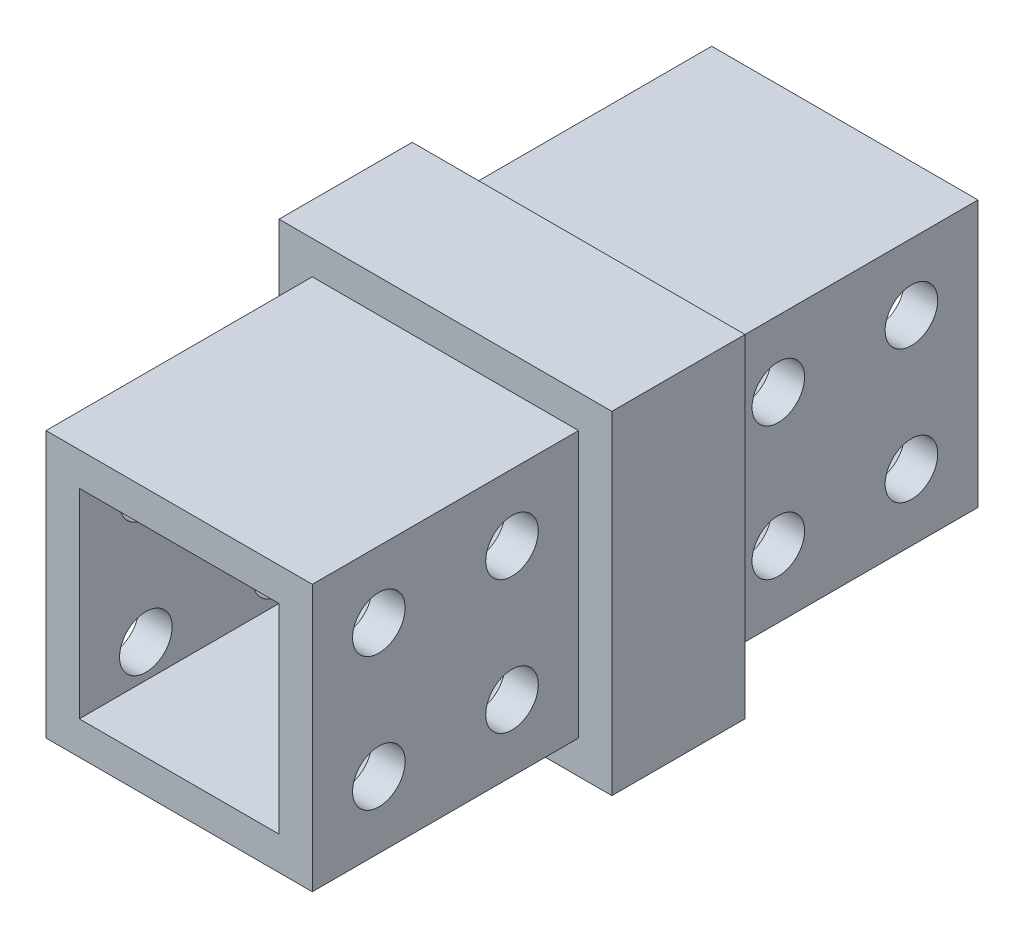
ISO-10303-21;
HEADER;
FILE_DESCRIPTION(('STEP AP214'),'2;1');
FILE_NAME('part.step','',(''),(''),'','','');
FILE_SCHEMA(('AUTOMOTIVE_DESIGN { 1 0 10303 214 1 1 1 1 }'));
ENDSEC;
DATA;
#1=APPLICATION_CONTEXT('core data for automotive mechanical design processes');
#2=APPLICATION_PROTOCOL_DEFINITION('international standard','automotive_design',2000,#1);
#3=PRODUCT_CONTEXT('',#1,'mechanical');
#4=PRODUCT('Part','Part','',(#3));
#5=PRODUCT_RELATED_PRODUCT_CATEGORY('part','',(#4));
#6=PRODUCT_DEFINITION_FORMATION('','',#4);
#7=PRODUCT_DEFINITION_CONTEXT('part definition',#1,'design');
#8=PRODUCT_DEFINITION('design','',#6,#7);
#9=PRODUCT_DEFINITION_SHAPE('','',#8);
#10=(LENGTH_UNIT() NAMED_UNIT(*) SI_UNIT(.MILLI.,.METRE.));
#11=(NAMED_UNIT(*) PLANE_ANGLE_UNIT() SI_UNIT($,.RADIAN.));
#12=(NAMED_UNIT(*) SI_UNIT($,.STERADIAN.) SOLID_ANGLE_UNIT());
#13=UNCERTAINTY_MEASURE_WITH_UNIT(LENGTH_MEASURE(1.E-05),#10,'distance_accuracy_value','');
#14=(GEOMETRIC_REPRESENTATION_CONTEXT(3) GLOBAL_UNCERTAINTY_ASSIGNED_CONTEXT((#13)) GLOBAL_UNIT_ASSIGNED_CONTEXT((#10,
#11,#12)) REPRESENTATION_CONTEXT('',''));
#15=CARTESIAN_POINT('',(0.,0.,0.));
#16=DIRECTION('',(0.,0.,1.));
#17=DIRECTION('',(1.,0.,0.));
#18=AXIS2_PLACEMENT_3D('',#15,#16,#17);
#19=CARTESIAN_POINT('',(-25.4,-6.35000000000001,57.15));
#20=DIRECTION('',(1.,0.,0.));
#21=DIRECTION('',(0.,1.,0.));
#22=AXIS2_PLACEMENT_3D('',#19,#20,#21);
#23=CYLINDRICAL_SURFACE('',#22,2.50825000000001);
#24=CARTESIAN_POINT('',(-22.225,-6.35000000000001,57.15));
#25=DIRECTION('',(-1.,0.,0.));
#26=DIRECTION('',(0.,-1.,0.));
#27=AXIS2_PLACEMENT_3D('',#24,#25,#26);
#28=CIRCLE('',#27,2.50825000000001);
#29=CARTESIAN_POINT('',(-22.225,-8.85825000000001,57.15));
#30=VERTEX_POINT('',#29);
#31=EDGE_CURVE('E204',#30,#30,#28,.F.);
#32=ORIENTED_EDGE('',*,*,#31,.T.);
#33=EDGE_LOOP('',(#32));
#34=FACE_BOUND('',#33,.T.);
#35=CARTESIAN_POINT('',(-25.4,-6.35000000000001,57.15));
#36=DIRECTION('',(1.,0.,0.));
#37=DIRECTION('',(0.,1.,0.));
#38=AXIS2_PLACEMENT_3D('',#35,#36,#37);
#39=CIRCLE('',#38,2.50825000000001);
#40=CARTESIAN_POINT('',(-25.4,-3.84175,57.15));
#41=VERTEX_POINT('',#40);
#42=EDGE_CURVE('E226',#41,#41,#39,.T.);
#43=ORIENTED_EDGE('',*,*,#42,.F.);
#44=EDGE_LOOP('',(#43));
#45=FACE_BOUND('',#44,.T.);
#46=ADVANCED_FACE('F32',(#34,#45),#23,.F.);
#47=CARTESIAN_POINT('',(-25.4,-19.05,44.45));
#48=DIRECTION('',(1.,0.,0.));
#49=DIRECTION('',(0.,1.,0.));
#50=AXIS2_PLACEMENT_3D('',#47,#48,#49);
#51=CYLINDRICAL_SURFACE('',#50,2.50825000000001);
#52=CARTESIAN_POINT('',(-22.225,-19.05,44.45));
#53=DIRECTION('',(-1.,0.,0.));
#54=DIRECTION('',(0.,-1.,0.));
#55=AXIS2_PLACEMENT_3D('',#52,#53,#54);
#56=CIRCLE('',#55,2.50825000000001);
#57=CARTESIAN_POINT('',(-22.225,-21.55825,44.45));
#58=VERTEX_POINT('',#57);
#59=EDGE_CURVE('E201',#58,#58,#56,.F.);
#60=ORIENTED_EDGE('',*,*,#59,.T.);
#61=EDGE_LOOP('',(#60));
#62=FACE_BOUND('',#61,.T.);
#63=CARTESIAN_POINT('',(-25.4,-19.05,44.45));
#64=DIRECTION('',(1.,0.,0.));
#65=DIRECTION('',(0.,1.,0.));
#66=AXIS2_PLACEMENT_3D('',#63,#64,#65);
#67=CIRCLE('',#66,2.50825000000001);
#68=CARTESIAN_POINT('',(-25.4,-16.54175,44.45));
#69=VERTEX_POINT('',#68);
#70=EDGE_CURVE('E208',#69,#69,#67,.T.);
#71=ORIENTED_EDGE('',*,*,#70,.F.);
#72=EDGE_LOOP('',(#71));
#73=FACE_BOUND('',#72,.T.);
#74=ADVANCED_FACE('F402',(#62,#73),#51,.F.);
#75=CARTESIAN_POINT('',(-25.4,-19.05,57.15));
#76=DIRECTION('',(1.,0.,0.));
#77=DIRECTION('',(0.,1.,0.));
#78=AXIS2_PLACEMENT_3D('',#75,#76,#77);
#79=CYLINDRICAL_SURFACE('',#78,2.50825);
#80=CARTESIAN_POINT('',(-22.225,-19.05,57.15));
#81=DIRECTION('',(-1.,0.,0.));
#82=DIRECTION('',(0.,-1.,0.));
#83=AXIS2_PLACEMENT_3D('',#80,#81,#82);
#84=CIRCLE('',#83,2.50825);
#85=CARTESIAN_POINT('',(-22.225,-21.55825,57.15));
#86=VERTEX_POINT('',#85);
#87=EDGE_CURVE('E198',#86,#86,#84,.F.);
#88=ORIENTED_EDGE('',*,*,#87,.T.);
#89=EDGE_LOOP('',(#88));
#90=FACE_BOUND('',#89,.T.);
#91=CARTESIAN_POINT('',(-25.4,-19.05,57.15));
#92=DIRECTION('',(1.,0.,0.));
#93=DIRECTION('',(0.,1.,0.));
#94=AXIS2_PLACEMENT_3D('',#91,#92,#93);
#95=CIRCLE('',#94,2.50825);
#96=CARTESIAN_POINT('',(-25.4,-16.54175,57.15));
#97=VERTEX_POINT('',#96);
#98=EDGE_CURVE('E221',#97,#97,#95,.T.);
#99=ORIENTED_EDGE('',*,*,#98,.F.);
#100=EDGE_LOOP('',(#99));
#101=FACE_BOUND('',#100,.T.);
#102=ADVANCED_FACE('F409',(#90,#101),#79,.F.);
#103=CARTESIAN_POINT('',(-25.4,-6.35000000000001,44.45));
#104=DIRECTION('',(1.,0.,0.));
#105=DIRECTION('',(0.,1.,0.));
#106=AXIS2_PLACEMENT_3D('',#103,#104,#105);
#107=CYLINDRICAL_SURFACE('',#106,2.50825000000001);
#108=CARTESIAN_POINT('',(-22.225,-6.35000000000001,44.45));
#109=DIRECTION('',(-1.,0.,0.));
#110=DIRECTION('',(0.,-1.,0.));
#111=AXIS2_PLACEMENT_3D('',#108,#109,#110);
#112=CIRCLE('',#111,2.50825000000001);
#113=CARTESIAN_POINT('',(-22.225,-8.85825000000001,44.45));
#114=VERTEX_POINT('',#113);
#115=EDGE_CURVE('E197',#114,#114,#112,.F.);
#116=ORIENTED_EDGE('',*,*,#115,.T.);
#117=EDGE_LOOP('',(#116));
#118=FACE_BOUND('',#117,.T.);
#119=CARTESIAN_POINT('',(-25.4,-6.35000000000001,44.45));
#120=DIRECTION('',(1.,0.,0.));
#121=DIRECTION('',(0.,1.,0.));
#122=AXIS2_PLACEMENT_3D('',#119,#120,#121);
#123=CIRCLE('',#122,2.50825000000001);
#124=CARTESIAN_POINT('',(-25.4,-3.84175,44.45));
#125=VERTEX_POINT('',#124);
#126=EDGE_CURVE('E214',#125,#125,#123,.T.);
#127=ORIENTED_EDGE('',*,*,#126,.F.);
#128=EDGE_LOOP('',(#127));
#129=FACE_BOUND('',#128,.T.);
#130=ADVANCED_FACE('F399',(#118,#129),#107,.F.);
#131=CARTESIAN_POINT('',(0.,0.,25.4));
#132=DIRECTION('',(-1.,0.,0.));
#133=DIRECTION('',(0.,-1.,0.));
#134=AXIS2_PLACEMENT_3D('',#131,#132,#133);
#135=PLANE('',#134);
#136=CARTESIAN_POINT('',(0.,-6.35,19.05));
#137=DIRECTION('',(-1.,0.,0.));
#138=DIRECTION('',(0.,1.,0.));
#139=AXIS2_PLACEMENT_3D('',#136,#137,#138);
#140=CIRCLE('',#139,2.50825000000001);
#141=CARTESIAN_POINT('',(0.,-3.84175,19.05));
#142=VERTEX_POINT('',#141);
#143=EDGE_CURVE('E361',#142,#142,#140,.T.);
#144=ORIENTED_EDGE('',*,*,#143,.T.);
#145=EDGE_LOOP('',(#144));
#146=FACE_BOUND('',#145,.T.);
#147=CARTESIAN_POINT('',(0.,-19.05,6.35));
#148=DIRECTION('',(-1.,0.,0.));
#149=DIRECTION('',(0.,1.,0.));
#150=AXIS2_PLACEMENT_3D('',#147,#148,#149);
#151=CIRCLE('',#150,2.50825);
#152=CARTESIAN_POINT('',(0.,-16.54175,6.35));
#153=VERTEX_POINT('',#152);
#154=EDGE_CURVE('E354',#153,#153,#151,.T.);
#155=ORIENTED_EDGE('',*,*,#154,.T.);
#156=EDGE_LOOP('',(#155));
#157=FACE_BOUND('',#156,.T.);
#158=CARTESIAN_POINT('',(0.,-19.05,19.05));
#159=DIRECTION('',(-1.,0.,0.));
#160=DIRECTION('',(0.,1.,0.));
#161=AXIS2_PLACEMENT_3D('',#158,#159,#160);
#162=CIRCLE('',#161,2.50825000000001);
#163=CARTESIAN_POINT('',(0.,-16.54175,19.05));
#164=VERTEX_POINT('',#163);
#165=EDGE_CURVE('E366',#164,#164,#162,.T.);
#166=ORIENTED_EDGE('',*,*,#165,.T.);
#167=EDGE_LOOP('',(#166));
#168=FACE_BOUND('',#167,.T.);
#169=CARTESIAN_POINT('',(0.,-6.35,6.35));
#170=DIRECTION('',(-1.,0.,0.));
#171=DIRECTION('',(0.,1.,0.));
#172=AXIS2_PLACEMENT_3D('',#169,#170,#171);
#173=CIRCLE('',#172,2.50825000000001);
#174=CARTESIAN_POINT('',(0.,-3.84175,6.35));
#175=VERTEX_POINT('',#174);
#176=EDGE_CURVE('E348',#175,#175,#173,.T.);
#177=ORIENTED_EDGE('',*,*,#176,.T.);
#178=EDGE_LOOP('',(#177));
#179=FACE_BOUND('',#178,.T.);
#180=DIRECTION('',(0.,1.,0.));
#181=VECTOR('',#180,1.);
#182=CARTESIAN_POINT('',(0.,0.,0.));
#183=LINE('',#182,#181);
#184=CARTESIAN_POINT('',(0.,-25.4,0.));
#185=VERTEX_POINT('',#184);
#186=CARTESIAN_POINT('',(0.,0.,0.));
#187=VERTEX_POINT('',#186);
#188=EDGE_CURVE('E294',#185,#187,#183,.T.);
#189=ORIENTED_EDGE('',*,*,#188,.T.);
#190=DIRECTION('',(0.,0.,-1.));
#191=VECTOR('',#190,1.);
#192=CARTESIAN_POINT('',(0.,0.,25.4));
#193=LINE('',#192,#191);
#194=CARTESIAN_POINT('',(0.,0.,25.4));
#195=VERTEX_POINT('',#194);
#196=EDGE_CURVE('E11',#195,#187,#193,.T.);
#197=ORIENTED_EDGE('',*,*,#196,.F.);
#198=DIRECTION('',(0.,1.,0.));
#199=VECTOR('',#198,1.);
#200=CARTESIAN_POINT('',(0.,0.,25.4));
#201=LINE('',#200,#199);
#202=CARTESIAN_POINT('',(0.,-25.4,25.4));
#203=VERTEX_POINT('',#202);
#204=EDGE_CURVE('E295',#203,#195,#201,.T.);
#205=ORIENTED_EDGE('',*,*,#204,.F.);
#206=DIRECTION('',(0.,0.,-1.));
#207=VECTOR('',#206,1.);
#208=CARTESIAN_POINT('',(0.,-25.4,25.4));
#209=LINE('',#208,#207);
#210=EDGE_CURVE('E308',#203,#185,#209,.T.);
#211=ORIENTED_EDGE('',*,*,#210,.T.);
#212=EDGE_LOOP('',(#189,#197,#205,#211));
#213=FACE_BOUND('',#212,.T.);
#214=ADVANCED_FACE('F34',(#146,#157,#168,#179,#213),#135,.F.);
#215=CARTESIAN_POINT('',(0.,0.,25.4));
#216=DIRECTION('',(0.,-1.,0.));
#217=DIRECTION('',(0.,0.,-1.));
#218=AXIS2_PLACEMENT_3D('',#215,#216,#217);
#219=PLANE('',#218);
#220=DIRECTION('',(-1.,0.,0.));
#221=VECTOR('',#220,1.);
#222=CARTESIAN_POINT('',(0.,0.,0.));
#223=LINE('',#222,#221);
#224=CARTESIAN_POINT('',(-25.4,0.,0.));
#225=VERTEX_POINT('',#224);
#226=EDGE_CURVE('E311',#187,#225,#223,.T.);
#227=ORIENTED_EDGE('',*,*,#226,.T.);
#228=DIRECTION('',(0.,0.,-1.));
#229=VECTOR('',#228,1.);
#230=CARTESIAN_POINT('',(-25.4,0.,25.4));
#231=LINE('',#230,#229);
#232=CARTESIAN_POINT('',(-25.4,0.,25.4));
#233=VERTEX_POINT('',#232);
#234=EDGE_CURVE('E41',#233,#225,#231,.T.);
#235=ORIENTED_EDGE('',*,*,#234,.F.);
#236=DIRECTION('',(-1.,0.,0.));
#237=VECTOR('',#236,1.);
#238=CARTESIAN_POINT('',(0.,0.,25.4));
#239=LINE('',#238,#237);
#240=EDGE_CURVE('E298',#195,#233,#239,.T.);
#241=ORIENTED_EDGE('',*,*,#240,.F.);
#242=ORIENTED_EDGE('',*,*,#196,.T.);
#243=EDGE_LOOP('',(#227,#235,#241,#242));
#244=FACE_BOUND('',#243,.T.);
#245=ADVANCED_FACE('F378',(#244),#219,.F.);
#246=CARTESIAN_POINT('',(-25.4,0.,25.4));
#247=DIRECTION('',(1.,0.,0.));
#248=DIRECTION('',(0.,1.,0.));
#249=AXIS2_PLACEMENT_3D('',#246,#247,#248);
#250=PLANE('',#249);
#251=CARTESIAN_POINT('',(-25.4,-6.35000000000001,19.05));
#252=DIRECTION('',(-1.,0.,0.));
#253=DIRECTION('',(0.,1.,0.));
#254=AXIS2_PLACEMENT_3D('',#251,#252,#253);
#255=CIRCLE('',#254,2.50825000000001);
#256=CARTESIAN_POINT('',(-25.4,-3.84175,19.05));
#257=VERTEX_POINT('',#256);
#258=EDGE_CURVE('E351',#257,#257,#255,.T.);
#259=ORIENTED_EDGE('',*,*,#258,.F.);
#260=EDGE_LOOP('',(#259));
#261=FACE_BOUND('',#260,.T.);
#262=CARTESIAN_POINT('',(-25.4,-19.05,6.35));
#263=DIRECTION('',(-1.,0.,0.));
#264=DIRECTION('',(0.,1.,0.));
#265=AXIS2_PLACEMENT_3D('',#262,#263,#264);
#266=CIRCLE('',#265,2.50825);
#267=CARTESIAN_POINT('',(-25.4,-16.54175,6.35));
#268=VERTEX_POINT('',#267);
#269=EDGE_CURVE('E357',#268,#268,#266,.T.);
#270=ORIENTED_EDGE('',*,*,#269,.F.);
#271=EDGE_LOOP('',(#270));
#272=FACE_BOUND('',#271,.T.);
#273=CARTESIAN_POINT('',(-25.4,-19.05,19.05));
#274=DIRECTION('',(-1.,0.,0.));
#275=DIRECTION('',(0.,1.,0.));
#276=AXIS2_PLACEMENT_3D('',#273,#274,#275);
#277=CIRCLE('',#276,2.50825000000001);
#278=CARTESIAN_POINT('',(-25.4,-16.54175,19.05));
#279=VERTEX_POINT('',#278);
#280=EDGE_CURVE('E358',#279,#279,#277,.T.);
#281=ORIENTED_EDGE('',*,*,#280,.F.);
#282=EDGE_LOOP('',(#281));
#283=FACE_BOUND('',#282,.T.);
#284=CARTESIAN_POINT('',(-25.4,-6.35000000000001,6.35));
#285=DIRECTION('',(-1.,0.,0.));
#286=DIRECTION('',(0.,1.,0.));
#287=AXIS2_PLACEMENT_3D('',#284,#285,#286);
#288=CIRCLE('',#287,2.50825000000001);
#289=CARTESIAN_POINT('',(-25.4,-3.84175,6.35));
#290=VERTEX_POINT('',#289);
#291=EDGE_CURVE('E331',#290,#290,#288,.T.);
#292=ORIENTED_EDGE('',*,*,#291,.F.);
#293=EDGE_LOOP('',(#292));
#294=FACE_BOUND('',#293,.T.);
#295=DIRECTION('',(0.,-1.,0.));
#296=VECTOR('',#295,1.);
#297=CARTESIAN_POINT('',(-25.4,0.,0.));
#298=LINE('',#297,#296);
#299=CARTESIAN_POINT('',(-25.4,-25.4,0.));
#300=VERTEX_POINT('',#299);
#301=EDGE_CURVE('E313',#225,#300,#298,.T.);
#302=ORIENTED_EDGE('',*,*,#301,.T.);
#303=DIRECTION('',(0.,0.,-1.));
#304=VECTOR('',#303,1.);
#305=CARTESIAN_POINT('',(-25.4,-25.4,25.4));
#306=LINE('',#305,#304);
#307=CARTESIAN_POINT('',(-25.4,-25.4,25.4));
#308=VERTEX_POINT('',#307);
#309=EDGE_CURVE('E318',#308,#300,#306,.T.);
#310=ORIENTED_EDGE('',*,*,#309,.F.);
#311=DIRECTION('',(0.,-1.,0.));
#312=VECTOR('',#311,1.);
#313=CARTESIAN_POINT('',(-25.4,0.,25.4));
#314=LINE('',#313,#312);
#315=EDGE_CURVE('E302',#233,#308,#314,.T.);
#316=ORIENTED_EDGE('',*,*,#315,.F.);
#317=ORIENTED_EDGE('',*,*,#234,.T.);
#318=EDGE_LOOP('',(#302,#310,#316,#317));
#319=FACE_BOUND('',#318,.T.);
#320=ADVANCED_FACE('F374',(#261,#272,#283,#294,#319),#250,.F.);
#321=CARTESIAN_POINT('',(0.,-25.4,25.4));
#322=DIRECTION('',(0.,1.,0.));
#323=DIRECTION('',(-1.,0.,0.));
#324=AXIS2_PLACEMENT_3D('',#321,#322,#323);
#325=PLANE('',#324);
#326=DIRECTION('',(1.,0.,0.));
#327=VECTOR('',#326,1.);
#328=CARTESIAN_POINT('',(0.,-25.4,0.));
#329=LINE('',#328,#327);
#330=EDGE_CURVE('E299',#300,#185,#329,.T.);
#331=ORIENTED_EDGE('',*,*,#330,.T.);
#332=ORIENTED_EDGE('',*,*,#210,.F.);
#333=DIRECTION('',(1.,0.,0.));
#334=VECTOR('',#333,1.);
#335=CARTESIAN_POINT('',(0.,-25.4,25.4));
#336=LINE('',#335,#334);
#337=EDGE_CURVE('E305',#308,#203,#336,.T.);
#338=ORIENTED_EDGE('',*,*,#337,.F.);
#339=ORIENTED_EDGE('',*,*,#309,.T.);
#340=EDGE_LOOP('',(#331,#332,#338,#339));
#341=FACE_BOUND('',#340,.T.);
#342=ADVANCED_FACE('F377',(#341),#325,.F.);
#343=CARTESIAN_POINT('',(0.,0.,0.));
#344=DIRECTION('',(0.,0.,-1.));
#345=DIRECTION('',(-1.,0.,0.));
#346=AXIS2_PLACEMENT_3D('',#343,#344,#345);
#347=PLANE('',#346);
#348=DIRECTION('',(0.,-1.,0.));
#349=VECTOR('',#348,1.);
#350=CARTESIAN_POINT('',(-22.225,-3.175,0.));
#351=LINE('',#350,#349);
#352=CARTESIAN_POINT('',(-22.225,-3.175,0.));
#353=VERTEX_POINT('',#352);
#354=CARTESIAN_POINT('',(-22.225,-22.225,0.));
#355=VERTEX_POINT('',#354);
#356=EDGE_CURVE('E150',#353,#355,#351,.T.);
#357=ORIENTED_EDGE('',*,*,#356,.T.);
#358=DIRECTION('',(1.,0.,0.));
#359=VECTOR('',#358,1.);
#360=CARTESIAN_POINT('',(-22.225,-22.225,0.));
#361=LINE('',#360,#359);
#362=CARTESIAN_POINT('',(-3.17499999999999,-22.225,0.));
#363=VERTEX_POINT('',#362);
#364=EDGE_CURVE('E159',#355,#363,#361,.T.);
#365=ORIENTED_EDGE('',*,*,#364,.T.);
#366=DIRECTION('',(0.,1.,0.));
#367=VECTOR('',#366,1.);
#368=CARTESIAN_POINT('',(-3.17499999999999,-3.175,0.));
#369=LINE('',#368,#367);
#370=CARTESIAN_POINT('',(-3.17499999999999,-3.175,0.));
#371=VERTEX_POINT('',#370);
#372=EDGE_CURVE('E49',#363,#371,#369,.T.);
#373=ORIENTED_EDGE('',*,*,#372,.T.);
#374=DIRECTION('',(-1.,0.,0.));
#375=VECTOR('',#374,1.);
#376=CARTESIAN_POINT('',(-22.225,-3.175,0.));
#377=LINE('',#376,#375);
#378=EDGE_CURVE('E156',#371,#353,#377,.T.);
#379=ORIENTED_EDGE('',*,*,#378,.T.);
#380=EDGE_LOOP('',(#357,#365,#373,#379));
#381=FACE_BOUND('',#380,.T.);
#382=ORIENTED_EDGE('',*,*,#188,.F.);
#383=ORIENTED_EDGE('',*,*,#330,.F.);
#384=ORIENTED_EDGE('',*,*,#301,.F.);
#385=ORIENTED_EDGE('',*,*,#226,.F.);
#386=EDGE_LOOP('',(#382,#383,#384,#385));
#387=FACE_BOUND('',#386,.T.);
#388=ADVANCED_FACE('F163',(#381,#387),#347,.T.);
#389=CARTESIAN_POINT('',(0.,0.,25.4));
#390=DIRECTION('',(0.,0.,1.));
#391=DIRECTION('',(1.,0.,0.));
#392=AXIS2_PLACEMENT_3D('',#389,#390,#391);
#393=PLANE('',#392);
#394=DIRECTION('',(0.,-1.,0.));
#395=VECTOR('',#394,1.);
#396=CARTESIAN_POINT('',(-28.575,3.175,25.4));
#397=LINE('',#396,#395);
#398=CARTESIAN_POINT('',(-28.575,3.175,25.4));
#399=VERTEX_POINT('',#398);
#400=CARTESIAN_POINT('',(-28.575,-28.575,25.4));
#401=VERTEX_POINT('',#400);
#402=EDGE_CURVE('E264',#399,#401,#397,.T.);
#403=ORIENTED_EDGE('',*,*,#402,.F.);
#404=DIRECTION('',(-1.,0.,0.));
#405=VECTOR('',#404,1.);
#406=CARTESIAN_POINT('',(-28.575,3.175,25.4));
#407=LINE('',#406,#405);
#408=CARTESIAN_POINT('',(3.175,3.175,25.4));
#409=VERTEX_POINT('',#408);
#410=EDGE_CURVE('E269',#409,#399,#407,.T.);
#411=ORIENTED_EDGE('',*,*,#410,.F.);
#412=DIRECTION('',(0.,1.,0.));
#413=VECTOR('',#412,1.);
#414=CARTESIAN_POINT('',(3.175,3.175,25.4));
#415=LINE('',#414,#413);
#416=CARTESIAN_POINT('',(3.17500000000001,-28.575,25.4));
#417=VERTEX_POINT('',#416);
#418=EDGE_CURVE('E280',#417,#409,#415,.T.);
#419=ORIENTED_EDGE('',*,*,#418,.F.);
#420=DIRECTION('',(1.,0.,0.));
#421=VECTOR('',#420,1.);
#422=CARTESIAN_POINT('',(-28.575,-28.575,25.4));
#423=LINE('',#422,#421);
#424=EDGE_CURVE('E278',#401,#417,#423,.T.);
#425=ORIENTED_EDGE('',*,*,#424,.F.);
#426=EDGE_LOOP('',(#403,#411,#419,#425));
#427=FACE_BOUND('',#426,.T.);
#428=ORIENTED_EDGE('',*,*,#337,.T.);
#429=ORIENTED_EDGE('',*,*,#204,.T.);
#430=ORIENTED_EDGE('',*,*,#240,.T.);
#431=ORIENTED_EDGE('',*,*,#315,.T.);
#432=EDGE_LOOP('',(#428,#429,#430,#431));
#433=FACE_BOUND('',#432,.T.);
#434=ADVANCED_FACE('F393',(#427,#433),#393,.F.);
#435=CARTESIAN_POINT('',(-28.575,3.175,38.1));
#436=DIRECTION('',(1.,0.,0.));
#437=DIRECTION('',(0.,1.,0.));
#438=AXIS2_PLACEMENT_3D('',#435,#436,#437);
#439=PLANE('',#438);
#440=ORIENTED_EDGE('',*,*,#402,.T.);
#441=DIRECTION('',(0.,0.,-1.));
#442=VECTOR('',#441,1.);
#443=CARTESIAN_POINT('',(-28.575,-28.575,38.1));
#444=LINE('',#443,#442);
#445=CARTESIAN_POINT('',(-28.575,-28.575,38.1));
#446=VERTEX_POINT('',#445);
#447=EDGE_CURVE('E291',#446,#401,#444,.T.);
#448=ORIENTED_EDGE('',*,*,#447,.F.);
#449=DIRECTION('',(0.,-1.,0.));
#450=VECTOR('',#449,1.);
#451=CARTESIAN_POINT('',(-28.575,3.175,38.1));
#452=LINE('',#451,#450);
#453=CARTESIAN_POINT('',(-28.575,3.175,38.1));
#454=VERTEX_POINT('',#453);
#455=EDGE_CURVE('E265',#454,#446,#452,.T.);
#456=ORIENTED_EDGE('',*,*,#455,.F.);
#457=DIRECTION('',(0.,0.,-1.));
#458=VECTOR('',#457,1.);
#459=CARTESIAN_POINT('',(-28.575,3.175,38.1));
#460=LINE('',#459,#458);
#461=EDGE_CURVE('E275',#454,#399,#460,.T.);
#462=ORIENTED_EDGE('',*,*,#461,.T.);
#463=EDGE_LOOP('',(#440,#448,#456,#462));
#464=FACE_BOUND('',#463,.T.);
#465=ADVANCED_FACE('F466',(#464),#439,.F.);
#466=CARTESIAN_POINT('',(-28.575,-28.575,38.1));
#467=DIRECTION('',(0.,1.,0.));
#468=DIRECTION('',(0.,0.,1.));
#469=AXIS2_PLACEMENT_3D('',#466,#467,#468);
#470=PLANE('',#469);
#471=ORIENTED_EDGE('',*,*,#424,.T.);
#472=DIRECTION('',(0.,0.,-1.));
#473=VECTOR('',#472,1.);
#474=CARTESIAN_POINT('',(3.17500000000001,-28.575,38.1));
#475=LINE('',#474,#473);
#476=CARTESIAN_POINT('',(3.17500000000001,-28.575,38.1));
#477=VERTEX_POINT('',#476);
#478=EDGE_CURVE('E288',#477,#417,#475,.T.);
#479=ORIENTED_EDGE('',*,*,#478,.F.);
#480=DIRECTION('',(1.,0.,0.));
#481=VECTOR('',#480,1.);
#482=CARTESIAN_POINT('',(-28.575,-28.575,38.1));
#483=LINE('',#482,#481);
#484=EDGE_CURVE('E268',#446,#477,#483,.T.);
#485=ORIENTED_EDGE('',*,*,#484,.F.);
#486=ORIENTED_EDGE('',*,*,#447,.T.);
#487=EDGE_LOOP('',(#471,#479,#485,#486));
#488=FACE_BOUND('',#487,.T.);
#489=ADVANCED_FACE('F474',(#488),#470,.F.);
#490=CARTESIAN_POINT('',(3.175,3.175,38.1));
#491=DIRECTION('',(-1.,0.,0.));
#492=DIRECTION('',(0.,-1.,0.));
#493=AXIS2_PLACEMENT_3D('',#490,#491,#492);
#494=PLANE('',#493);
#495=ORIENTED_EDGE('',*,*,#418,.T.);
#496=DIRECTION('',(0.,0.,-1.));
#497=VECTOR('',#496,1.);
#498=CARTESIAN_POINT('',(3.175,3.175,38.1));
#499=LINE('',#498,#497);
#500=CARTESIAN_POINT('',(3.175,3.175,38.1));
#501=VERTEX_POINT('',#500);
#502=EDGE_CURVE('E285',#501,#409,#499,.T.);
#503=ORIENTED_EDGE('',*,*,#502,.F.);
#504=DIRECTION('',(0.,1.,0.));
#505=VECTOR('',#504,1.);
#506=CARTESIAN_POINT('',(3.175,3.175,38.1));
#507=LINE('',#506,#505);
#508=EDGE_CURVE('E271',#477,#501,#507,.T.);
#509=ORIENTED_EDGE('',*,*,#508,.F.);
#510=ORIENTED_EDGE('',*,*,#478,.T.);
#511=EDGE_LOOP('',(#495,#503,#509,#510));
#512=FACE_BOUND('',#511,.T.);
#513=ADVANCED_FACE('F470',(#512),#494,.F.);
#514=CARTESIAN_POINT('',(-28.575,3.175,38.1));
#515=DIRECTION('',(0.,-1.,0.));
#516=DIRECTION('',(0.,0.,-1.));
#517=AXIS2_PLACEMENT_3D('',#514,#515,#516);
#518=PLANE('',#517);
#519=ORIENTED_EDGE('',*,*,#410,.T.);
#520=ORIENTED_EDGE('',*,*,#461,.F.);
#521=DIRECTION('',(-1.,0.,0.));
#522=VECTOR('',#521,1.);
#523=CARTESIAN_POINT('',(-28.575,3.175,38.1));
#524=LINE('',#523,#522);
#525=EDGE_CURVE('E273',#501,#454,#524,.T.);
#526=ORIENTED_EDGE('',*,*,#525,.F.);
#527=ORIENTED_EDGE('',*,*,#502,.T.);
#528=EDGE_LOOP('',(#519,#520,#526,#527));
#529=FACE_BOUND('',#528,.T.);
#530=ADVANCED_FACE('F460',(#529),#518,.F.);
#531=CARTESIAN_POINT('',(0.,0.,38.1));
#532=DIRECTION('',(0.,0.,1.));
#533=DIRECTION('',(1.,0.,0.));
#534=AXIS2_PLACEMENT_3D('',#531,#532,#533);
#535=PLANE('',#534);
#536=DIRECTION('',(0.,-1.,0.));
#537=VECTOR('',#536,1.);
#538=CARTESIAN_POINT('',(-25.4,0.,38.1));
#539=LINE('',#538,#537);
#540=CARTESIAN_POINT('',(-25.4,0.,38.1));
#541=VERTEX_POINT('',#540);
#542=CARTESIAN_POINT('',(-25.4,-25.4,38.1));
#543=VERTEX_POINT('',#542);
#544=EDGE_CURVE('E229',#541,#543,#539,.T.);
#545=ORIENTED_EDGE('',*,*,#544,.F.);
#546=DIRECTION('',(-1.,0.,0.));
#547=VECTOR('',#546,1.);
#548=CARTESIAN_POINT('',(-25.4,0.,38.1));
#549=LINE('',#548,#547);
#550=CARTESIAN_POINT('',(0.,0.,38.1));
#551=VERTEX_POINT('',#550);
#552=EDGE_CURVE('E236',#551,#541,#549,.T.);
#553=ORIENTED_EDGE('',*,*,#552,.F.);
#554=DIRECTION('',(0.,1.,0.));
#555=VECTOR('',#554,1.);
#556=CARTESIAN_POINT('',(0.,0.,38.1));
#557=LINE('',#556,#555);
#558=CARTESIAN_POINT('',(0.,-25.4,38.1));
#559=VERTEX_POINT('',#558);
#560=EDGE_CURVE('E248',#559,#551,#557,.T.);
#561=ORIENTED_EDGE('',*,*,#560,.F.);
#562=DIRECTION('',(1.,0.,0.));
#563=VECTOR('',#562,1.);
#564=CARTESIAN_POINT('',(-25.4,-25.4,38.1));
#565=LINE('',#564,#563);
#566=EDGE_CURVE('E245',#543,#559,#565,.T.);
#567=ORIENTED_EDGE('',*,*,#566,.F.);
#568=EDGE_LOOP('',(#545,#553,#561,#567));
#569=FACE_BOUND('',#568,.T.);
#570=ORIENTED_EDGE('',*,*,#455,.T.);
#571=ORIENTED_EDGE('',*,*,#484,.T.);
#572=ORIENTED_EDGE('',*,*,#508,.T.);
#573=ORIENTED_EDGE('',*,*,#525,.T.);
#574=EDGE_LOOP('',(#570,#571,#572,#573));
#575=FACE_BOUND('',#574,.T.);
#576=ADVANCED_FACE('F448',(#569,#575),#535,.T.);
#577=CARTESIAN_POINT('',(-25.4,0.,63.5));
#578=DIRECTION('',(1.,0.,0.));
#579=DIRECTION('',(0.,1.,0.));
#580=AXIS2_PLACEMENT_3D('',#577,#578,#579);
#581=PLANE('',#580);
#582=ORIENTED_EDGE('',*,*,#126,.T.);
#583=EDGE_LOOP('',(#582));
#584=FACE_BOUND('',#583,.T.);
#585=ORIENTED_EDGE('',*,*,#98,.T.);
#586=EDGE_LOOP('',(#585));
#587=FACE_BOUND('',#586,.T.);
#588=ORIENTED_EDGE('',*,*,#70,.T.);
#589=EDGE_LOOP('',(#588));
#590=FACE_BOUND('',#589,.T.);
#591=ORIENTED_EDGE('',*,*,#42,.T.);
#592=EDGE_LOOP('',(#591));
#593=FACE_BOUND('',#592,.T.);
#594=ORIENTED_EDGE('',*,*,#544,.T.);
#595=DIRECTION('',(0.,0.,-1.));
#596=VECTOR('',#595,1.);
#597=CARTESIAN_POINT('',(-25.4,-25.4,63.5));
#598=LINE('',#597,#596);
#599=CARTESIAN_POINT('',(-25.4,-25.4,63.5));
#600=VERTEX_POINT('',#599);
#601=EDGE_CURVE('E261',#600,#543,#598,.T.);
#602=ORIENTED_EDGE('',*,*,#601,.F.);
#603=DIRECTION('',(0.,-1.,0.));
#604=VECTOR('',#603,1.);
#605=CARTESIAN_POINT('',(-25.4,0.,63.5));
#606=LINE('',#605,#604);
#607=CARTESIAN_POINT('',(-25.4,0.,63.5));
#608=VERTEX_POINT('',#607);
#609=EDGE_CURVE('E232',#608,#600,#606,.T.);
#610=ORIENTED_EDGE('',*,*,#609,.F.);
#611=DIRECTION('',(0.,0.,-1.));
#612=VECTOR('',#611,1.);
#613=CARTESIAN_POINT('',(-25.4,0.,63.5));
#614=LINE('',#613,#612);
#615=EDGE_CURVE('E242',#608,#541,#614,.T.);
#616=ORIENTED_EDGE('',*,*,#615,.T.);
#617=EDGE_LOOP('',(#594,#602,#610,#616));
#618=FACE_BOUND('',#617,.T.);
#619=ADVANCED_FACE('F451',(#584,#587,#590,#593,#618),#581,.F.);
#620=CARTESIAN_POINT('',(-25.4,-25.4,63.5));
#621=DIRECTION('',(0.,1.,0.));
#622=DIRECTION('',(-1.,0.,0.));
#623=AXIS2_PLACEMENT_3D('',#620,#621,#622);
#624=PLANE('',#623);
#625=ORIENTED_EDGE('',*,*,#566,.T.);
#626=DIRECTION('',(0.,0.,-1.));
#627=VECTOR('',#626,1.);
#628=CARTESIAN_POINT('',(0.,-25.4,63.5));
#629=LINE('',#628,#627);
#630=CARTESIAN_POINT('',(0.,-25.4,63.5));
#631=VERTEX_POINT('',#630);
#632=EDGE_CURVE('E258',#631,#559,#629,.T.);
#633=ORIENTED_EDGE('',*,*,#632,.F.);
#634=DIRECTION('',(1.,0.,0.));
#635=VECTOR('',#634,1.);
#636=CARTESIAN_POINT('',(-25.4,-25.4,63.5));
#637=LINE('',#636,#635);
#638=EDGE_CURVE('E235',#600,#631,#637,.T.);
#639=ORIENTED_EDGE('',*,*,#638,.F.);
#640=ORIENTED_EDGE('',*,*,#601,.T.);
#641=EDGE_LOOP('',(#625,#633,#639,#640));
#642=FACE_BOUND('',#641,.T.);
#643=ADVANCED_FACE('F434',(#642),#624,.F.);
#644=CARTESIAN_POINT('',(0.,0.,63.5));
#645=DIRECTION('',(-1.,0.,0.));
#646=DIRECTION('',(0.,-1.,0.));
#647=AXIS2_PLACEMENT_3D('',#644,#645,#646);
#648=PLANE('',#647);
#649=CARTESIAN_POINT('',(0.,-6.35,44.45));
#650=DIRECTION('',(1.,0.,0.));
#651=DIRECTION('',(0.,1.,0.));
#652=AXIS2_PLACEMENT_3D('',#649,#650,#651);
#653=CIRCLE('',#652,2.50825000000001);
#654=CARTESIAN_POINT('',(0.,-3.84175,44.45));
#655=VERTEX_POINT('',#654);
#656=EDGE_CURVE('E218',#655,#655,#653,.T.);
#657=ORIENTED_EDGE('',*,*,#656,.F.);
#658=EDGE_LOOP('',(#657));
#659=FACE_BOUND('',#658,.T.);
#660=CARTESIAN_POINT('',(0.,-19.05,57.15));
#661=DIRECTION('',(1.,0.,0.));
#662=DIRECTION('',(0.,1.,0.));
#663=AXIS2_PLACEMENT_3D('',#660,#661,#662);
#664=CIRCLE('',#663,2.50825);
#665=CARTESIAN_POINT('',(0.,-16.54175,57.15));
#666=VERTEX_POINT('',#665);
#667=EDGE_CURVE('E211',#666,#666,#664,.T.);
#668=ORIENTED_EDGE('',*,*,#667,.F.);
#669=EDGE_LOOP('',(#668));
#670=FACE_BOUND('',#669,.T.);
#671=CARTESIAN_POINT('',(0.,-19.05,44.45));
#672=DIRECTION('',(1.,0.,0.));
#673=DIRECTION('',(0.,1.,0.));
#674=AXIS2_PLACEMENT_3D('',#671,#672,#673);
#675=CIRCLE('',#674,2.50825000000001);
#676=CARTESIAN_POINT('',(0.,-16.54175,44.45));
#677=VERTEX_POINT('',#676);
#678=EDGE_CURVE('E207',#677,#677,#675,.T.);
#679=ORIENTED_EDGE('',*,*,#678,.F.);
#680=EDGE_LOOP('',(#679));
#681=FACE_BOUND('',#680,.T.);
#682=CARTESIAN_POINT('',(0.,-6.35,57.15));
#683=DIRECTION('',(1.,0.,0.));
#684=DIRECTION('',(0.,1.,0.));
#685=AXIS2_PLACEMENT_3D('',#682,#683,#684);
#686=CIRCLE('',#685,2.50825000000001);
#687=CARTESIAN_POINT('',(0.,-3.84175,57.15));
#688=VERTEX_POINT('',#687);
#689=EDGE_CURVE('E217',#688,#688,#686,.T.);
#690=ORIENTED_EDGE('',*,*,#689,.F.);
#691=EDGE_LOOP('',(#690));
#692=FACE_BOUND('',#691,.T.);
#693=ORIENTED_EDGE('',*,*,#560,.T.);
#694=DIRECTION('',(0.,0.,-1.));
#695=VECTOR('',#694,1.);
#696=CARTESIAN_POINT('',(0.,0.,63.5));
#697=LINE('',#696,#695);
#698=CARTESIAN_POINT('',(0.,0.,63.5));
#699=VERTEX_POINT('',#698);
#700=EDGE_CURVE('E255',#699,#551,#697,.T.);
#701=ORIENTED_EDGE('',*,*,#700,.F.);
#702=DIRECTION('',(0.,1.,0.));
#703=VECTOR('',#702,1.);
#704=CARTESIAN_POINT('',(0.,0.,63.5));
#705=LINE('',#704,#703);
#706=EDGE_CURVE('E238',#631,#699,#705,.T.);
#707=ORIENTED_EDGE('',*,*,#706,.F.);
#708=ORIENTED_EDGE('',*,*,#632,.T.);
#709=EDGE_LOOP('',(#693,#701,#707,#708));
#710=FACE_BOUND('',#709,.T.);
#711=ADVANCED_FACE('F431',(#659,#670,#681,#692,#710),#648,.F.);
#712=CARTESIAN_POINT('',(-25.4,0.,63.5));
#713=DIRECTION('',(0.,-1.,0.));
#714=DIRECTION('',(0.,0.,-1.));
#715=AXIS2_PLACEMENT_3D('',#712,#713,#714);
#716=PLANE('',#715);
#717=ORIENTED_EDGE('',*,*,#552,.T.);
#718=ORIENTED_EDGE('',*,*,#615,.F.);
#719=DIRECTION('',(-1.,0.,0.));
#720=VECTOR('',#719,1.);
#721=CARTESIAN_POINT('',(-25.4,0.,63.5));
#722=LINE('',#721,#720);
#723=EDGE_CURVE('E240',#699,#608,#722,.T.);
#724=ORIENTED_EDGE('',*,*,#723,.F.);
#725=ORIENTED_EDGE('',*,*,#700,.T.);
#726=EDGE_LOOP('',(#717,#718,#724,#725));
#727=FACE_BOUND('',#726,.T.);
#728=ADVANCED_FACE('F425',(#727),#716,.F.);
#729=CARTESIAN_POINT('',(0.,0.,63.5));
#730=DIRECTION('',(0.,0.,1.));
#731=DIRECTION('',(1.,0.,0.));
#732=AXIS2_PLACEMENT_3D('',#729,#730,#731);
#733=PLANE('',#732);
#734=DIRECTION('',(0.,-1.,0.));
#735=VECTOR('',#734,1.);
#736=CARTESIAN_POINT('',(-22.225,-3.175,63.5));
#737=LINE('',#736,#735);
#738=CARTESIAN_POINT('',(-22.225,-3.175,63.5));
#739=VERTEX_POINT('',#738);
#740=CARTESIAN_POINT('',(-22.225,-22.225,63.5));
#741=VERTEX_POINT('',#740);
#742=EDGE_CURVE('E57',#739,#741,#737,.T.);
#743=ORIENTED_EDGE('',*,*,#742,.F.);
#744=DIRECTION('',(-1.,0.,0.));
#745=VECTOR('',#744,1.);
#746=CARTESIAN_POINT('',(-22.225,-3.175,63.5));
#747=LINE('',#746,#745);
#748=CARTESIAN_POINT('',(-3.17499999999999,-3.175,63.5));
#749=VERTEX_POINT('',#748);
#750=EDGE_CURVE('E166',#749,#739,#747,.T.);
#751=ORIENTED_EDGE('',*,*,#750,.F.);
#752=DIRECTION('',(0.,1.,0.));
#753=VECTOR('',#752,1.);
#754=CARTESIAN_POINT('',(-3.17499999999999,-3.175,63.5));
#755=LINE('',#754,#753);
#756=CARTESIAN_POINT('',(-3.17499999999999,-22.225,63.5));
#757=VERTEX_POINT('',#756);
#758=EDGE_CURVE('E169',#757,#749,#755,.T.);
#759=ORIENTED_EDGE('',*,*,#758,.F.);
#760=DIRECTION('',(1.,0.,0.));
#761=VECTOR('',#760,1.);
#762=CARTESIAN_POINT('',(-22.225,-22.225,63.5));
#763=LINE('',#762,#761);
#764=EDGE_CURVE('E178',#741,#757,#763,.T.);
#765=ORIENTED_EDGE('',*,*,#764,.F.);
#766=EDGE_LOOP('',(#743,#751,#759,#765));
#767=FACE_BOUND('',#766,.T.);
#768=ORIENTED_EDGE('',*,*,#609,.T.);
#769=ORIENTED_EDGE('',*,*,#638,.T.);
#770=ORIENTED_EDGE('',*,*,#706,.T.);
#771=ORIENTED_EDGE('',*,*,#723,.T.);
#772=EDGE_LOOP('',(#768,#769,#770,#771));
#773=FACE_BOUND('',#772,.T.);
#774=ADVANCED_FACE('F417',(#767,#773),#733,.T.);
#775=CARTESIAN_POINT('',(-3.17499999999999,-6.35,57.15));
#776=DIRECTION('',(1.,0.,0.));
#777=DIRECTION('',(0.,1.,0.));
#778=AXIS2_PLACEMENT_3D('',#775,#776,#777);
#779=CIRCLE('',#778,2.50825000000001);
#780=CARTESIAN_POINT('',(-3.17499999999999,-3.84175,57.15));
#781=VERTEX_POINT('',#780);
#782=EDGE_CURVE('E194',#781,#781,#779,.F.);
#783=ORIENTED_EDGE('',*,*,#782,.T.);
#784=EDGE_LOOP('',(#783));
#785=FACE_BOUND('',#784,.T.);
#786=ORIENTED_EDGE('',*,*,#689,.T.);
#787=EDGE_LOOP('',(#786));
#788=FACE_BOUND('',#787,.T.);
#789=ADVANCED_FACE('F405',(#785,#788),#23,.F.);
#790=CARTESIAN_POINT('',(-3.17499999999999,-19.05,44.45));
#791=DIRECTION('',(1.,0.,0.));
#792=DIRECTION('',(0.,1.,0.));
#793=AXIS2_PLACEMENT_3D('',#790,#791,#792);
#794=CIRCLE('',#793,2.50825000000001);
#795=CARTESIAN_POINT('',(-3.17499999999999,-16.54175,44.45));
#796=VERTEX_POINT('',#795);
#797=EDGE_CURVE('E191',#796,#796,#794,.F.);
#798=ORIENTED_EDGE('',*,*,#797,.T.);
#799=EDGE_LOOP('',(#798));
#800=FACE_BOUND('',#799,.T.);
#801=ORIENTED_EDGE('',*,*,#678,.T.);
#802=EDGE_LOOP('',(#801));
#803=FACE_BOUND('',#802,.T.);
#804=ADVANCED_FACE('F412',(#800,#803),#51,.F.);
#805=CARTESIAN_POINT('',(-3.17499999999999,-19.05,57.15));
#806=DIRECTION('',(1.,0.,0.));
#807=DIRECTION('',(0.,1.,0.));
#808=AXIS2_PLACEMENT_3D('',#805,#806,#807);
#809=CIRCLE('',#808,2.50825);
#810=CARTESIAN_POINT('',(-3.17499999999999,-16.54175,57.15));
#811=VERTEX_POINT('',#810);
#812=EDGE_CURVE('E188',#811,#811,#809,.F.);
#813=ORIENTED_EDGE('',*,*,#812,.T.);
#814=EDGE_LOOP('',(#813));
#815=FACE_BOUND('',#814,.T.);
#816=ORIENTED_EDGE('',*,*,#667,.T.);
#817=EDGE_LOOP('',(#816));
#818=FACE_BOUND('',#817,.T.);
#819=ADVANCED_FACE('F423',(#815,#818),#79,.F.);
#820=CARTESIAN_POINT('',(-3.17499999999999,-6.35,44.45));
#821=DIRECTION('',(1.,0.,0.));
#822=DIRECTION('',(0.,1.,0.));
#823=AXIS2_PLACEMENT_3D('',#820,#821,#822);
#824=CIRCLE('',#823,2.50825000000001);
#825=CARTESIAN_POINT('',(-3.17499999999999,-3.84175,44.45));
#826=VERTEX_POINT('',#825);
#827=EDGE_CURVE('E184',#826,#826,#824,.F.);
#828=ORIENTED_EDGE('',*,*,#827,.T.);
#829=EDGE_LOOP('',(#828));
#830=FACE_BOUND('',#829,.T.);
#831=ORIENTED_EDGE('',*,*,#656,.T.);
#832=EDGE_LOOP('',(#831));
#833=FACE_BOUND('',#832,.T.);
#834=ADVANCED_FACE('F572',(#830,#833),#107,.F.);
#835=CARTESIAN_POINT('',(-22.225,-3.175,0.));
#836=DIRECTION('',(-1.,0.,0.));
#837=DIRECTION('',(0.,-1.,0.));
#838=AXIS2_PLACEMENT_3D('',#835,#836,#837);
#839=PLANE('',#838);
#840=CARTESIAN_POINT('',(-22.225,-6.35000000000001,19.05));
#841=DIRECTION('',(-1.,0.,0.));
#842=DIRECTION('',(0.,-1.,0.));
#843=AXIS2_PLACEMENT_3D('',#840,#841,#842);
#844=CIRCLE('',#843,2.50825000000001);
#845=CARTESIAN_POINT('',(-22.225,-8.85825000000001,19.05));
#846=VERTEX_POINT('',#845);
#847=EDGE_CURVE('E172',#846,#846,#844,.F.);
#848=ORIENTED_EDGE('',*,*,#847,.F.);
#849=EDGE_LOOP('',(#848));
#850=FACE_BOUND('',#849,.T.);
#851=CARTESIAN_POINT('',(-22.225,-19.05,6.35));
#852=DIRECTION('',(-1.,0.,0.));
#853=DIRECTION('',(0.,-1.,0.));
#854=AXIS2_PLACEMENT_3D('',#851,#852,#853);
#855=CIRCLE('',#854,2.50825);
#856=CARTESIAN_POINT('',(-22.225,-21.55825,6.35));
#857=VERTEX_POINT('',#856);
#858=EDGE_CURVE('E337',#857,#857,#855,.F.);
#859=ORIENTED_EDGE('',*,*,#858,.F.);
#860=EDGE_LOOP('',(#859));
#861=FACE_BOUND('',#860,.T.);
#862=CARTESIAN_POINT('',(-22.225,-19.05,19.05));
#863=DIRECTION('',(-1.,0.,0.));
#864=DIRECTION('',(0.,-1.,0.));
#865=AXIS2_PLACEMENT_3D('',#862,#863,#864);
#866=CIRCLE('',#865,2.50825000000001);
#867=CARTESIAN_POINT('',(-22.225,-21.55825,19.05));
#868=VERTEX_POINT('',#867);
#869=EDGE_CURVE('E334',#868,#868,#866,.F.);
#870=ORIENTED_EDGE('',*,*,#869,.F.);
#871=EDGE_LOOP('',(#870));
#872=FACE_BOUND('',#871,.T.);
#873=CARTESIAN_POINT('',(-22.225,-6.35000000000001,6.35));
#874=DIRECTION('',(-1.,0.,0.));
#875=DIRECTION('',(0.,-1.,0.));
#876=AXIS2_PLACEMENT_3D('',#873,#874,#875);
#877=CIRCLE('',#876,2.50825000000001);
#878=CARTESIAN_POINT('',(-22.225,-8.85825000000001,6.35));
#879=VERTEX_POINT('',#878);
#880=EDGE_CURVE('E330',#879,#879,#877,.F.);
#881=ORIENTED_EDGE('',*,*,#880,.F.);
#882=EDGE_LOOP('',(#881));
#883=FACE_BOUND('',#882,.T.);
#884=ORIENTED_EDGE('',*,*,#59,.F.);
#885=EDGE_LOOP('',(#884));
#886=FACE_BOUND('',#885,.T.);
#887=ORIENTED_EDGE('',*,*,#115,.F.);
#888=EDGE_LOOP('',(#887));
#889=FACE_BOUND('',#888,.T.);
#890=ORIENTED_EDGE('',*,*,#742,.T.);
#891=DIRECTION('',(0.,0.,1.));
#892=VECTOR('',#891,1.);
#893=CARTESIAN_POINT('',(-22.225,-22.225,0.));
#894=LINE('',#893,#892);
#895=EDGE_CURVE('E145',#355,#741,#894,.T.);
#896=ORIENTED_EDGE('',*,*,#895,.F.);
#897=ORIENTED_EDGE('',*,*,#356,.F.);
#898=DIRECTION('',(0.,0.,1.));
#899=VECTOR('',#898,1.);
#900=CARTESIAN_POINT('',(-22.225,-3.175,0.));
#901=LINE('',#900,#899);
#902=EDGE_CURVE('E182',#353,#739,#901,.T.);
#903=ORIENTED_EDGE('',*,*,#902,.T.);
#904=EDGE_LOOP('',(#890,#896,#897,#903));
#905=FACE_BOUND('',#904,.T.);
#906=ORIENTED_EDGE('',*,*,#87,.F.);
#907=EDGE_LOOP('',(#906));
#908=FACE_BOUND('',#907,.T.);
#909=ORIENTED_EDGE('',*,*,#31,.F.);
#910=EDGE_LOOP('',(#909));
#911=FACE_BOUND('',#910,.T.);
#912=ADVANCED_FACE('F147',(#850,#861,#872,#883,#886,#889,#905,#908,#911),#839,.F.);
#913=CARTESIAN_POINT('',(-3.17499999999999,-3.175,0.));
#914=DIRECTION('',(1.,0.,0.));
#915=DIRECTION('',(0.,1.,0.));
#916=AXIS2_PLACEMENT_3D('',#913,#914,#915);
#917=PLANE('',#916);
#918=CARTESIAN_POINT('',(-3.17499999999999,-6.35,19.05));
#919=DIRECTION('',(1.,0.,0.));
#920=DIRECTION('',(0.,1.,0.));
#921=AXIS2_PLACEMENT_3D('',#918,#919,#920);
#922=CIRCLE('',#921,2.50825000000001);
#923=CARTESIAN_POINT('',(-3.17499999999999,-3.84175,19.05));
#924=VERTEX_POINT('',#923);
#925=EDGE_CURVE('E36',#924,#924,#922,.F.);
#926=ORIENTED_EDGE('',*,*,#925,.F.);
#927=EDGE_LOOP('',(#926));
#928=FACE_BOUND('',#927,.T.);
#929=CARTESIAN_POINT('',(-3.17499999999999,-19.05,6.35));
#930=DIRECTION('',(1.,0.,0.));
#931=DIRECTION('',(0.,1.,0.));
#932=AXIS2_PLACEMENT_3D('',#929,#930,#931);
#933=CIRCLE('',#932,2.50825);
#934=CARTESIAN_POINT('',(-3.17499999999999,-16.54175,6.35));
#935=VERTEX_POINT('',#934);
#936=EDGE_CURVE('E335',#935,#935,#933,.F.);
#937=ORIENTED_EDGE('',*,*,#936,.F.);
#938=EDGE_LOOP('',(#937));
#939=FACE_BOUND('',#938,.T.);
#940=CARTESIAN_POINT('',(-3.17499999999999,-19.05,19.05));
#941=DIRECTION('',(1.,0.,0.));
#942=DIRECTION('',(0.,1.,0.));
#943=AXIS2_PLACEMENT_3D('',#940,#941,#942);
#944=CIRCLE('',#943,2.50825000000001);
#945=CARTESIAN_POINT('',(-3.17499999999999,-16.54175,19.05));
#946=VERTEX_POINT('',#945);
#947=EDGE_CURVE('E332',#946,#946,#944,.F.);
#948=ORIENTED_EDGE('',*,*,#947,.F.);
#949=EDGE_LOOP('',(#948));
#950=FACE_BOUND('',#949,.T.);
#951=CARTESIAN_POINT('',(-3.17499999999999,-6.35,6.35));
#952=DIRECTION('',(1.,0.,0.));
#953=DIRECTION('',(0.,1.,0.));
#954=AXIS2_PLACEMENT_3D('',#951,#952,#953);
#955=CIRCLE('',#954,2.50825000000001);
#956=CARTESIAN_POINT('',(-3.17499999999999,-3.84175,6.35));
#957=VERTEX_POINT('',#956);
#958=EDGE_CURVE('E327',#957,#957,#955,.F.);
#959=ORIENTED_EDGE('',*,*,#958,.F.);
#960=EDGE_LOOP('',(#959));
#961=FACE_BOUND('',#960,.T.);
#962=ORIENTED_EDGE('',*,*,#797,.F.);
#963=EDGE_LOOP('',(#962));
#964=FACE_BOUND('',#963,.T.);
#965=ORIENTED_EDGE('',*,*,#827,.F.);
#966=EDGE_LOOP('',(#965));
#967=FACE_BOUND('',#966,.T.);
#968=ORIENTED_EDGE('',*,*,#758,.T.);
#969=DIRECTION('',(0.,0.,1.));
#970=VECTOR('',#969,1.);
#971=CARTESIAN_POINT('',(-3.17499999999999,-3.175,0.));
#972=LINE('',#971,#970);
#973=EDGE_CURVE('E185',#371,#749,#972,.T.);
#974=ORIENTED_EDGE('',*,*,#973,.F.);
#975=ORIENTED_EDGE('',*,*,#372,.F.);
#976=DIRECTION('',(0.,0.,1.));
#977=VECTOR('',#976,1.);
#978=CARTESIAN_POINT('',(-3.17499999999999,-22.225,0.));
#979=LINE('',#978,#977);
#980=EDGE_CURVE('E155',#363,#757,#979,.T.);
#981=ORIENTED_EDGE('',*,*,#980,.T.);
#982=EDGE_LOOP('',(#968,#974,#975,#981));
#983=FACE_BOUND('',#982,.T.);
#984=ORIENTED_EDGE('',*,*,#812,.F.);
#985=EDGE_LOOP('',(#984));
#986=FACE_BOUND('',#985,.T.);
#987=ORIENTED_EDGE('',*,*,#782,.F.);
#988=EDGE_LOOP('',(#987));
#989=FACE_BOUND('',#988,.T.);
#990=ADVANCED_FACE('F597',(#928,#939,#950,#961,#964,#967,#983,#986,#989),#917,.F.);
#991=CARTESIAN_POINT('',(-22.225,-3.175,0.));
#992=DIRECTION('',(0.,1.,0.));
#993=DIRECTION('',(0.,0.,1.));
#994=AXIS2_PLACEMENT_3D('',#991,#992,#993);
#995=PLANE('',#994);
#996=ORIENTED_EDGE('',*,*,#750,.T.);
#997=ORIENTED_EDGE('',*,*,#902,.F.);
#998=ORIENTED_EDGE('',*,*,#378,.F.);
#999=ORIENTED_EDGE('',*,*,#973,.T.);
#1000=EDGE_LOOP('',(#996,#997,#998,#999));
#1001=FACE_BOUND('',#1000,.T.);
#1002=ADVANCED_FACE('F608',(#1001),#995,.F.);
#1003=CARTESIAN_POINT('',(-22.225,-22.225,0.));
#1004=DIRECTION('',(0.,-1.,0.));
#1005=DIRECTION('',(0.,0.,-1.));
#1006=AXIS2_PLACEMENT_3D('',#1003,#1004,#1005);
#1007=PLANE('',#1006);
#1008=ORIENTED_EDGE('',*,*,#764,.T.);
#1009=ORIENTED_EDGE('',*,*,#980,.F.);
#1010=ORIENTED_EDGE('',*,*,#364,.F.);
#1011=ORIENTED_EDGE('',*,*,#895,.T.);
#1012=EDGE_LOOP('',(#1008,#1009,#1010,#1011));
#1013=FACE_BOUND('',#1012,.T.);
#1014=ADVANCED_FACE('F160',(#1013),#1007,.F.);
#1015=CARTESIAN_POINT('',(-25.4,-6.35000000000001,6.35));
#1016=DIRECTION('',(1.,0.,0.));
#1017=DIRECTION('',(0.,1.,0.));
#1018=AXIS2_PLACEMENT_3D('',#1015,#1016,#1017);
#1019=CYLINDRICAL_SURFACE('',#1018,2.50825000000001);
#1020=ORIENTED_EDGE('',*,*,#176,.F.);
#1021=EDGE_LOOP('',(#1020));
#1022=FACE_BOUND('',#1021,.T.);
#1023=ORIENTED_EDGE('',*,*,#958,.T.);
#1024=EDGE_LOOP('',(#1023));
#1025=FACE_BOUND('',#1024,.T.);
#1026=ADVANCED_FACE('F616',(#1022,#1025),#1019,.F.);
#1027=CARTESIAN_POINT('',(-25.4,-19.05,19.05));
#1028=DIRECTION('',(1.,0.,0.));
#1029=DIRECTION('',(0.,1.,0.));
#1030=AXIS2_PLACEMENT_3D('',#1027,#1028,#1029);
#1031=CYLINDRICAL_SURFACE('',#1030,2.50825000000001);
#1032=ORIENTED_EDGE('',*,*,#165,.F.);
#1033=EDGE_LOOP('',(#1032));
#1034=FACE_BOUND('',#1033,.T.);
#1035=ORIENTED_EDGE('',*,*,#947,.T.);
#1036=EDGE_LOOP('',(#1035));
#1037=FACE_BOUND('',#1036,.T.);
#1038=ADVANCED_FACE('F621',(#1034,#1037),#1031,.F.);
#1039=CARTESIAN_POINT('',(-25.4,-19.05,6.35));
#1040=DIRECTION('',(1.,0.,0.));
#1041=DIRECTION('',(0.,1.,0.));
#1042=AXIS2_PLACEMENT_3D('',#1039,#1040,#1041);
#1043=CYLINDRICAL_SURFACE('',#1042,2.50825);
#1044=ORIENTED_EDGE('',*,*,#154,.F.);
#1045=EDGE_LOOP('',(#1044));
#1046=FACE_BOUND('',#1045,.T.);
#1047=ORIENTED_EDGE('',*,*,#936,.T.);
#1048=EDGE_LOOP('',(#1047));
#1049=FACE_BOUND('',#1048,.T.);
#1050=ADVANCED_FACE('F632',(#1046,#1049),#1043,.F.);
#1051=CARTESIAN_POINT('',(-25.4,-6.35000000000001,19.05));
#1052=DIRECTION('',(1.,0.,0.));
#1053=DIRECTION('',(0.,1.,0.));
#1054=AXIS2_PLACEMENT_3D('',#1051,#1052,#1053);
#1055=CYLINDRICAL_SURFACE('',#1054,2.50825000000001);
#1056=ORIENTED_EDGE('',*,*,#143,.F.);
#1057=EDGE_LOOP('',(#1056));
#1058=FACE_BOUND('',#1057,.T.);
#1059=ORIENTED_EDGE('',*,*,#925,.T.);
#1060=EDGE_LOOP('',(#1059));
#1061=FACE_BOUND('',#1060,.T.);
#1062=ADVANCED_FACE('F642',(#1058,#1061),#1055,.F.);
#1063=ORIENTED_EDGE('',*,*,#291,.T.);
#1064=EDGE_LOOP('',(#1063));
#1065=FACE_BOUND('',#1064,.T.);
#1066=ORIENTED_EDGE('',*,*,#880,.T.);
#1067=EDGE_LOOP('',(#1066));
#1068=FACE_BOUND('',#1067,.T.);
#1069=ADVANCED_FACE('F624',(#1065,#1068),#1019,.F.);
#1070=ORIENTED_EDGE('',*,*,#280,.T.);
#1071=EDGE_LOOP('',(#1070));
#1072=FACE_BOUND('',#1071,.T.);
#1073=ORIENTED_EDGE('',*,*,#869,.T.);
#1074=EDGE_LOOP('',(#1073));
#1075=FACE_BOUND('',#1074,.T.);
#1076=ADVANCED_FACE('F372',(#1072,#1075),#1031,.F.);
#1077=ORIENTED_EDGE('',*,*,#269,.T.);
#1078=EDGE_LOOP('',(#1077));
#1079=FACE_BOUND('',#1078,.T.);
#1080=ORIENTED_EDGE('',*,*,#858,.T.);
#1081=EDGE_LOOP('',(#1080));
#1082=FACE_BOUND('',#1081,.T.);
#1083=ADVANCED_FACE('F645',(#1079,#1082),#1043,.F.);
#1084=ORIENTED_EDGE('',*,*,#258,.T.);
#1085=EDGE_LOOP('',(#1084));
#1086=FACE_BOUND('',#1085,.T.);
#1087=ORIENTED_EDGE('',*,*,#847,.T.);
#1088=EDGE_LOOP('',(#1087));
#1089=FACE_BOUND('',#1088,.T.);
#1090=ADVANCED_FACE('F655',(#1086,#1089),#1055,.F.);
#1091=CLOSED_SHELL('',(#46,#74,#102,#130,#214,#245,#320,#342,#388,#434,#465,#489,#513,#530,#576,
#619,#643,#711,#728,#774,#789,#804,#819,#834,#912,#990,#1002,#1014,#1026,#1038,#1050,#1062,
#1069,#1076,#1083,#1090));
#1092=MANIFOLD_SOLID_BREP('B2',#1091);
#1093=ADVANCED_BREP_SHAPE_REPRESENTATION('',(#18,#1092),#14);
#1094=SHAPE_DEFINITION_REPRESENTATION(#9,#1093);
ENDSEC;
END-ISO-10303-21;
